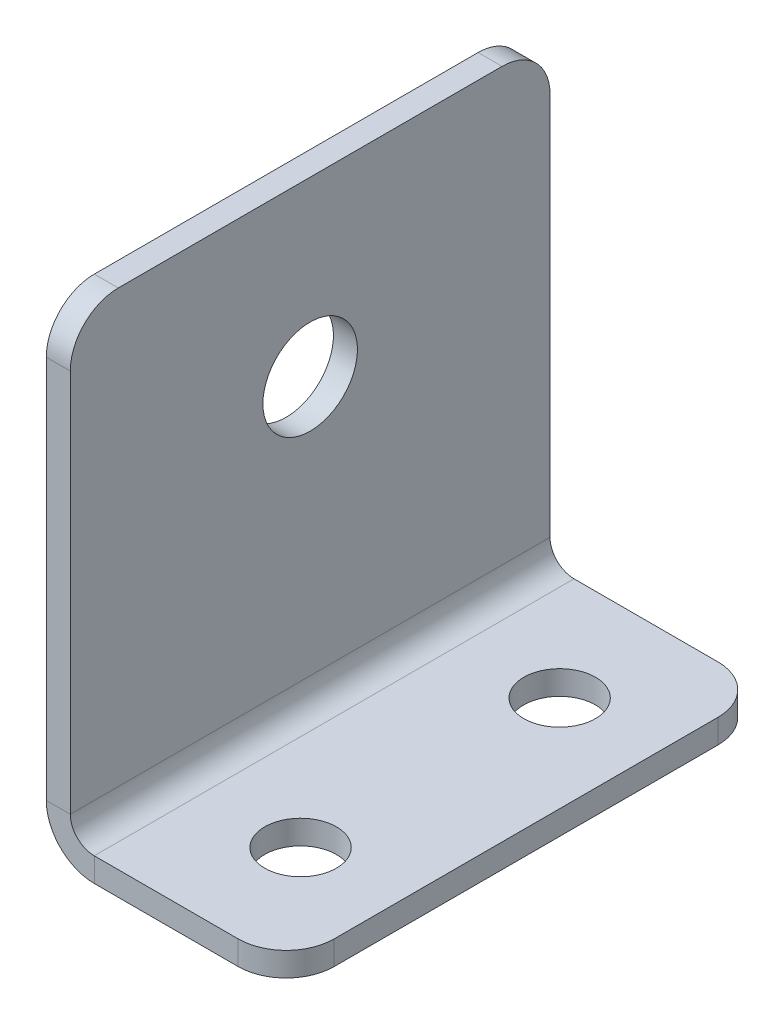
ISO-10303-21;
HEADER;
FILE_DESCRIPTION(('STEP AP214'),'2;1');
FILE_NAME('part.step','',(''),(''),'','','');
FILE_SCHEMA(('AUTOMOTIVE_DESIGN { 1 0 10303 214 1 1 1 1 }'));
ENDSEC;
DATA;
#1=APPLICATION_CONTEXT('core data for automotive mechanical design processes');
#2=APPLICATION_PROTOCOL_DEFINITION('international standard','automotive_design',2000,#1);
#3=PRODUCT_CONTEXT('',#1,'mechanical');
#4=PRODUCT('Part','Part','',(#3));
#5=PRODUCT_RELATED_PRODUCT_CATEGORY('part','',(#4));
#6=PRODUCT_DEFINITION_FORMATION('','',#4);
#7=PRODUCT_DEFINITION_CONTEXT('part definition',#1,'design');
#8=PRODUCT_DEFINITION('design','',#6,#7);
#9=PRODUCT_DEFINITION_SHAPE('','',#8);
#10=(LENGTH_UNIT() NAMED_UNIT(*) SI_UNIT(.MILLI.,.METRE.));
#11=(NAMED_UNIT(*) PLANE_ANGLE_UNIT() SI_UNIT($,.RADIAN.));
#12=(NAMED_UNIT(*) SI_UNIT($,.STERADIAN.) SOLID_ANGLE_UNIT());
#13=UNCERTAINTY_MEASURE_WITH_UNIT(LENGTH_MEASURE(1.E-05),#10,'distance_accuracy_value','');
#14=(GEOMETRIC_REPRESENTATION_CONTEXT(3) GLOBAL_UNCERTAINTY_ASSIGNED_CONTEXT((#13)) GLOBAL_UNIT_ASSIGNED_CONTEXT((#10,
#11,#12)) REPRESENTATION_CONTEXT('',''));
#15=CARTESIAN_POINT('',(0.,0.,0.));
#16=DIRECTION('',(0.,0.,1.));
#17=DIRECTION('',(1.,0.,0.));
#18=AXIS2_PLACEMENT_3D('',#15,#16,#17);
#19=CARTESIAN_POINT('',(1.27,1.27,0.));
#20=DIRECTION('',(0.,0.,1.));
#21=DIRECTION('',(0.,1.,0.));
#22=AXIS2_PLACEMENT_3D('',#19,#20,#21);
#23=PLANE('',#22);
#24=DIRECTION('',(0.,1.,0.));
#25=VECTOR('',#24,1.);
#26=CARTESIAN_POINT('',(0.,1.27,0.));
#27=LINE('',#26,#25);
#28=CARTESIAN_POINT('',(0.,2.54,0.));
#29=VERTEX_POINT('',#28);
#30=CARTESIAN_POINT('',(0.,22.86,0.));
#31=VERTEX_POINT('',#30);
#32=EDGE_CURVE('E204',#29,#31,#27,.T.);
#33=ORIENTED_EDGE('',*,*,#32,.T.);
#34=DIRECTION('',(1.,0.,0.));
#35=VECTOR('',#34,1.);
#36=CARTESIAN_POINT('',(1.27,22.86,0.));
#37=LINE('',#36,#35);
#38=CARTESIAN_POINT('',(1.27,22.86,0.));
#39=VERTEX_POINT('',#38);
#40=EDGE_CURVE('E171',#31,#39,#37,.T.);
#41=ORIENTED_EDGE('',*,*,#40,.T.);
#42=DIRECTION('',(0.,1.,0.));
#43=VECTOR('',#42,1.);
#44=CARTESIAN_POINT('',(1.27,1.27,0.));
#45=LINE('',#44,#43);
#46=CARTESIAN_POINT('',(1.27,2.54,0.));
#47=VERTEX_POINT('',#46);
#48=EDGE_CURVE('E169',#47,#39,#45,.T.);
#49=ORIENTED_EDGE('',*,*,#48,.F.);
#50=DIRECTION('',(1.,0.,0.));
#51=VECTOR('',#50,1.);
#52=CARTESIAN_POINT('',(1.27,2.54,0.));
#53=LINE('',#52,#51);
#54=EDGE_CURVE('E141',#29,#47,#53,.T.);
#55=ORIENTED_EDGE('',*,*,#54,.F.);
#56=EDGE_LOOP('',(#33,#41,#49,#55));
#57=FACE_BOUND('',#56,.T.);
#58=ADVANCED_FACE('F50',(#57),#23,.F.);
#59=CARTESIAN_POINT('',(1.27,25.4,25.4));
#60=DIRECTION('',(0.,1.,0.));
#61=DIRECTION('',(0.,0.,-1.));
#62=AXIS2_PLACEMENT_3D('',#59,#60,#61);
#63=PLANE('',#62);
#64=DIRECTION('',(0.,0.,-1.));
#65=VECTOR('',#64,1.);
#66=CARTESIAN_POINT('',(1.27,25.4,25.4));
#67=LINE('',#66,#65);
#68=CARTESIAN_POINT('',(1.27,25.4,22.86));
#69=VERTEX_POINT('',#68);
#70=CARTESIAN_POINT('',(1.27,25.4,2.54));
#71=VERTEX_POINT('',#70);
#72=EDGE_CURVE('E173',#69,#71,#67,.T.);
#73=ORIENTED_EDGE('',*,*,#72,.T.);
#74=DIRECTION('',(-1.,0.,0.));
#75=VECTOR('',#74,1.);
#76=CARTESIAN_POINT('',(1.27,25.4,2.54));
#77=LINE('',#76,#75);
#78=CARTESIAN_POINT('',(0.,25.4,2.54));
#79=VERTEX_POINT('',#78);
#80=EDGE_CURVE('E71',#71,#79,#77,.T.);
#81=ORIENTED_EDGE('',*,*,#80,.T.);
#82=DIRECTION('',(0.,0.,1.));
#83=VECTOR('',#82,1.);
#84=CARTESIAN_POINT('',(0.,25.4,25.4));
#85=LINE('',#84,#83);
#86=CARTESIAN_POINT('',(0.,25.4,22.86));
#87=VERTEX_POINT('',#86);
#88=EDGE_CURVE('E206',#87,#79,#85,.F.);
#89=ORIENTED_EDGE('',*,*,#88,.F.);
#90=DIRECTION('',(1.,0.,0.));
#91=VECTOR('',#90,1.);
#92=CARTESIAN_POINT('',(1.27,25.4,22.86));
#93=LINE('',#92,#91);
#94=EDGE_CURVE('E239',#87,#69,#93,.T.);
#95=ORIENTED_EDGE('',*,*,#94,.T.);
#96=EDGE_LOOP('',(#73,#81,#89,#95));
#97=FACE_BOUND('',#96,.T.);
#98=ADVANCED_FACE('F252',(#97),#63,.T.);
#99=CARTESIAN_POINT('',(1.27,1.27,25.4));
#100=DIRECTION('',(0.,0.,1.));
#101=DIRECTION('',(0.,1.,0.));
#102=AXIS2_PLACEMENT_3D('',#99,#100,#101);
#103=PLANE('',#102);
#104=DIRECTION('',(0.,1.,0.));
#105=VECTOR('',#104,1.);
#106=CARTESIAN_POINT('',(1.27,1.27,25.4));
#107=LINE('',#106,#105);
#108=CARTESIAN_POINT('',(1.27,2.54,25.4));
#109=VERTEX_POINT('',#108);
#110=CARTESIAN_POINT('',(1.27,22.86,25.4));
#111=VERTEX_POINT('',#110);
#112=EDGE_CURVE('E177',#109,#111,#107,.T.);
#113=ORIENTED_EDGE('',*,*,#112,.T.);
#114=DIRECTION('',(1.,0.,0.));
#115=VECTOR('',#114,1.);
#116=CARTESIAN_POINT('',(1.27,22.86,25.4));
#117=LINE('',#116,#115);
#118=CARTESIAN_POINT('',(0.,22.86,25.4));
#119=VERTEX_POINT('',#118);
#120=EDGE_CURVE('E13',#111,#119,#117,.F.);
#121=ORIENTED_EDGE('',*,*,#120,.T.);
#122=DIRECTION('',(0.,1.,0.));
#123=VECTOR('',#122,1.);
#124=CARTESIAN_POINT('',(0.,1.27,25.4));
#125=LINE('',#124,#123);
#126=CARTESIAN_POINT('',(0.,2.54,25.4));
#127=VERTEX_POINT('',#126);
#128=EDGE_CURVE('E197',#127,#119,#125,.T.);
#129=ORIENTED_EDGE('',*,*,#128,.F.);
#130=DIRECTION('',(1.,0.,0.));
#131=VECTOR('',#130,1.);
#132=CARTESIAN_POINT('',(1.27,2.54,25.4));
#133=LINE('',#132,#131);
#134=EDGE_CURVE('E154',#127,#109,#133,.T.);
#135=ORIENTED_EDGE('',*,*,#134,.T.);
#136=EDGE_LOOP('',(#113,#121,#129,#135));
#137=FACE_BOUND('',#136,.T.);
#138=ADVANCED_FACE('F284',(#137),#103,.T.);
#139=CARTESIAN_POINT('',(2.54,2.54,25.4));
#140=DIRECTION('',(0.,0.,1.));
#141=DIRECTION('',(1.,0.,0.));
#142=AXIS2_PLACEMENT_3D('',#139,#140,#141);
#143=PLANE('',#142);
#144=ORIENTED_EDGE('',*,*,#134,.F.);
#145=CARTESIAN_POINT('',(2.54,2.54,25.4));
#146=DIRECTION('',(0.,0.,1.));
#147=DIRECTION('',(1.,0.,0.));
#148=AXIS2_PLACEMENT_3D('',#145,#146,#147);
#149=CIRCLE('',#148,2.54);
#150=CARTESIAN_POINT('',(2.54,0.,25.4));
#151=VERTEX_POINT('',#150);
#152=EDGE_CURVE('E201',#127,#151,#149,.T.);
#153=ORIENTED_EDGE('',*,*,#152,.T.);
#154=DIRECTION('',(0.,1.,0.));
#155=VECTOR('',#154,1.);
#156=CARTESIAN_POINT('',(2.54,1.27,25.4));
#157=LINE('',#156,#155);
#158=CARTESIAN_POINT('',(2.54,1.27,25.4));
#159=VERTEX_POINT('',#158);
#160=EDGE_CURVE('E211',#151,#159,#157,.T.);
#161=ORIENTED_EDGE('',*,*,#160,.T.);
#162=CARTESIAN_POINT('',(2.54,2.54,25.4));
#163=DIRECTION('',(0.,0.,-1.));
#164=DIRECTION('',(-1.,0.,0.));
#165=AXIS2_PLACEMENT_3D('',#162,#163,#164);
#166=CIRCLE('',#165,1.27);
#167=EDGE_CURVE('E164',#109,#159,#166,.F.);
#168=ORIENTED_EDGE('',*,*,#167,.F.);
#169=EDGE_LOOP('',(#144,#153,#161,#168));
#170=FACE_BOUND('',#169,.T.);
#171=ADVANCED_FACE('F267',(#170),#143,.T.);
#172=CARTESIAN_POINT('',(1.27,1.27,25.4));
#173=DIRECTION('',(0.,0.,1.));
#174=DIRECTION('',(-1.,0.,0.));
#175=AXIS2_PLACEMENT_3D('',#172,#173,#174);
#176=PLANE('',#175);
#177=DIRECTION('',(1.,0.,0.));
#178=VECTOR('',#177,1.);
#179=CARTESIAN_POINT('',(1.27,0.,25.4));
#180=LINE('',#179,#178);
#181=CARTESIAN_POINT('',(10.16,0.,25.4));
#182=VERTEX_POINT('',#181);
#183=EDGE_CURVE('E196',#182,#151,#180,.F.);
#184=ORIENTED_EDGE('',*,*,#183,.F.);
#185=DIRECTION('',(0.,-1.,0.));
#186=VECTOR('',#185,1.);
#187=CARTESIAN_POINT('',(10.16,1.27,25.4));
#188=LINE('',#187,#186);
#189=CARTESIAN_POINT('',(10.16,1.27,25.4));
#190=VERTEX_POINT('',#189);
#191=EDGE_CURVE('E153',#182,#190,#188,.F.);
#192=ORIENTED_EDGE('',*,*,#191,.T.);
#193=DIRECTION('',(-1.,0.,0.));
#194=VECTOR('',#193,1.);
#195=CARTESIAN_POINT('',(1.27,1.27,25.4));
#196=LINE('',#195,#194);
#197=EDGE_CURVE('E184',#190,#159,#196,.T.);
#198=ORIENTED_EDGE('',*,*,#197,.T.);
#199=ORIENTED_EDGE('',*,*,#160,.F.);
#200=EDGE_LOOP('',(#184,#192,#198,#199));
#201=FACE_BOUND('',#200,.T.);
#202=ADVANCED_FACE('F263',(#201),#176,.T.);
#203=CARTESIAN_POINT('',(12.7,1.27,25.4));
#204=DIRECTION('',(-1.,0.,0.));
#205=DIRECTION('',(0.,0.,-1.));
#206=AXIS2_PLACEMENT_3D('',#203,#204,#205);
#207=PLANE('',#206);
#208=DIRECTION('',(0.,0.,-1.));
#209=VECTOR('',#208,1.);
#210=CARTESIAN_POINT('',(12.7,1.27,25.4));
#211=LINE('',#210,#209);
#212=CARTESIAN_POINT('',(12.7,1.27,22.86));
#213=VERTEX_POINT('',#212);
#214=CARTESIAN_POINT('',(12.7,1.27,2.54));
#215=VERTEX_POINT('',#214);
#216=EDGE_CURVE('E179',#213,#215,#211,.T.);
#217=ORIENTED_EDGE('',*,*,#216,.F.);
#218=DIRECTION('',(0.,1.,0.));
#219=VECTOR('',#218,1.);
#220=CARTESIAN_POINT('',(12.7,1.27,22.86));
#221=LINE('',#220,#219);
#222=CARTESIAN_POINT('',(12.7,0.,22.86));
#223=VERTEX_POINT('',#222);
#224=EDGE_CURVE('E226',#213,#223,#221,.F.);
#225=ORIENTED_EDGE('',*,*,#224,.T.);
#226=DIRECTION('',(0.,0.,-1.));
#227=VECTOR('',#226,1.);
#228=CARTESIAN_POINT('',(12.7,0.,25.4));
#229=LINE('',#228,#227);
#230=CARTESIAN_POINT('',(12.7,0.,2.54));
#231=VERTEX_POINT('',#230);
#232=EDGE_CURVE('E193',#223,#231,#229,.T.);
#233=ORIENTED_EDGE('',*,*,#232,.T.);
#234=DIRECTION('',(0.,-1.,0.));
#235=VECTOR('',#234,1.);
#236=CARTESIAN_POINT('',(12.7,1.27,2.54));
#237=LINE('',#236,#235);
#238=EDGE_CURVE('E223',#231,#215,#237,.F.);
#239=ORIENTED_EDGE('',*,*,#238,.T.);
#240=EDGE_LOOP('',(#217,#225,#233,#239));
#241=FACE_BOUND('',#240,.T.);
#242=ADVANCED_FACE('F348',(#241),#207,.F.);
#243=CARTESIAN_POINT('',(1.27,1.27,0.));
#244=DIRECTION('',(0.,0.,1.));
#245=DIRECTION('',(-1.,0.,0.));
#246=AXIS2_PLACEMENT_3D('',#243,#244,#245);
#247=PLANE('',#246);
#248=DIRECTION('',(-1.,0.,0.));
#249=VECTOR('',#248,1.);
#250=CARTESIAN_POINT('',(1.27,1.27,0.));
#251=LINE('',#250,#249);
#252=CARTESIAN_POINT('',(10.16,1.27,0.));
#253=VERTEX_POINT('',#252);
#254=CARTESIAN_POINT('',(2.54,1.27,0.));
#255=VERTEX_POINT('',#254);
#256=EDGE_CURVE('E255',#253,#255,#251,.T.);
#257=ORIENTED_EDGE('',*,*,#256,.F.);
#258=DIRECTION('',(0.,-1.,0.));
#259=VECTOR('',#258,1.);
#260=CARTESIAN_POINT('',(10.16,1.27,0.));
#261=LINE('',#260,#259);
#262=CARTESIAN_POINT('',(10.16,0.,0.));
#263=VERTEX_POINT('',#262);
#264=EDGE_CURVE('E232',#253,#263,#261,.T.);
#265=ORIENTED_EDGE('',*,*,#264,.T.);
#266=DIRECTION('',(1.,0.,0.));
#267=VECTOR('',#266,1.);
#268=CARTESIAN_POINT('',(1.27,0.,0.));
#269=LINE('',#268,#267);
#270=CARTESIAN_POINT('',(2.54,0.,0.));
#271=VERTEX_POINT('',#270);
#272=EDGE_CURVE('E194',#263,#271,#269,.F.);
#273=ORIENTED_EDGE('',*,*,#272,.T.);
#274=DIRECTION('',(0.,1.,0.));
#275=VECTOR('',#274,1.);
#276=CARTESIAN_POINT('',(2.54,1.27,0.));
#277=LINE('',#276,#275);
#278=EDGE_CURVE('E181',#271,#255,#277,.T.);
#279=ORIENTED_EDGE('',*,*,#278,.T.);
#280=EDGE_LOOP('',(#257,#265,#273,#279));
#281=FACE_BOUND('',#280,.T.);
#282=ADVANCED_FACE('F273',(#281),#247,.F.);
#283=CARTESIAN_POINT('',(2.54,2.54,0.));
#284=DIRECTION('',(0.,0.,-1.));
#285=DIRECTION('',(-1.,0.,0.));
#286=AXIS2_PLACEMENT_3D('',#283,#284,#285);
#287=PLANE('',#286);
#288=CARTESIAN_POINT('',(2.54,2.54,0.));
#289=DIRECTION('',(0.,0.,1.));
#290=DIRECTION('',(1.,0.,0.));
#291=AXIS2_PLACEMENT_3D('',#288,#289,#290);
#292=CIRCLE('',#291,2.54);
#293=EDGE_CURVE('E148',#271,#29,#292,.F.);
#294=ORIENTED_EDGE('',*,*,#293,.T.);
#295=ORIENTED_EDGE('',*,*,#54,.T.);
#296=CARTESIAN_POINT('',(2.54,2.54,0.));
#297=DIRECTION('',(0.,0.,1.));
#298=DIRECTION('',(1.,0.,0.));
#299=AXIS2_PLACEMENT_3D('',#296,#297,#298);
#300=CIRCLE('',#299,1.27);
#301=EDGE_CURVE('E145',#255,#47,#300,.F.);
#302=ORIENTED_EDGE('',*,*,#301,.F.);
#303=ORIENTED_EDGE('',*,*,#278,.F.);
#304=EDGE_LOOP('',(#294,#295,#302,#303));
#305=FACE_BOUND('',#304,.T.);
#306=ADVANCED_FACE('F143',(#305),#287,.T.);
#307=CARTESIAN_POINT('',(1.27,1.27,25.4));
#308=DIRECTION('',(0.,-1.,0.));
#309=DIRECTION('',(0.,0.,-1.));
#310=AXIS2_PLACEMENT_3D('',#307,#308,#309);
#311=PLANE('',#310);
#312=CARTESIAN_POINT('',(7.62,1.27,19.558));
#313=DIRECTION('',(0.,1.,0.));
#314=DIRECTION('',(0.,0.,1.));
#315=AXIS2_PLACEMENT_3D('',#312,#313,#314);
#316=CIRCLE('',#315,1.89865);
#317=CARTESIAN_POINT('',(7.62,1.27,21.45665));
#318=VERTEX_POINT('',#317);
#319=EDGE_CURVE('E538',#318,#318,#316,.T.);
#320=ORIENTED_EDGE('',*,*,#319,.F.);
#321=EDGE_LOOP('',(#320));
#322=FACE_BOUND('',#321,.T.);
#323=CARTESIAN_POINT('',(7.62,1.27,5.842));
#324=DIRECTION('',(0.,1.,0.));
#325=DIRECTION('',(0.,0.,1.));
#326=AXIS2_PLACEMENT_3D('',#323,#324,#325);
#327=CIRCLE('',#326,1.89865);
#328=CARTESIAN_POINT('',(7.62,1.27,7.74065));
#329=VERTEX_POINT('',#328);
#330=EDGE_CURVE('E532',#329,#329,#327,.T.);
#331=ORIENTED_EDGE('',*,*,#330,.F.);
#332=EDGE_LOOP('',(#331));
#333=FACE_BOUND('',#332,.T.);
#334=ORIENTED_EDGE('',*,*,#197,.F.);
#335=CARTESIAN_POINT('',(10.16,1.27,22.86));
#336=DIRECTION('',(0.,-1.,0.));
#337=DIRECTION('',(0.,0.,-1.));
#338=AXIS2_PLACEMENT_3D('',#335,#336,#337);
#339=CIRCLE('',#338,2.54);
#340=EDGE_CURVE('E221',#190,#213,#339,.F.);
#341=ORIENTED_EDGE('',*,*,#340,.T.);
#342=ORIENTED_EDGE('',*,*,#216,.T.);
#343=CARTESIAN_POINT('',(10.16,1.27,2.54));
#344=DIRECTION('',(0.,-1.,0.));
#345=DIRECTION('',(0.,0.,-1.));
#346=AXIS2_PLACEMENT_3D('',#343,#344,#345);
#347=CIRCLE('',#346,2.54);
#348=EDGE_CURVE('E219',#215,#253,#347,.F.);
#349=ORIENTED_EDGE('',*,*,#348,.T.);
#350=ORIENTED_EDGE('',*,*,#256,.T.);
#351=DIRECTION('',(0.,0.,-1.));
#352=VECTOR('',#351,1.);
#353=CARTESIAN_POINT('',(2.54,1.27,25.4));
#354=LINE('',#353,#352);
#355=EDGE_CURVE('E163',#255,#159,#354,.F.);
#356=ORIENTED_EDGE('',*,*,#355,.T.);
#357=EDGE_LOOP('',(#334,#341,#342,#349,#350,#356));
#358=FACE_BOUND('',#357,.T.);
#359=ADVANCED_FACE('F269',(#322,#333,#358),#311,.F.);
#360=CARTESIAN_POINT('',(1.27,1.27,25.4));
#361=DIRECTION('',(-1.,0.,0.));
#362=DIRECTION('',(0.,0.,1.));
#363=AXIS2_PLACEMENT_3D('',#360,#361,#362);
#364=PLANE('',#363);
#365=CARTESIAN_POINT('',(1.27,16.256,12.7));
#366=DIRECTION('',(-1.,0.,0.));
#367=DIRECTION('',(0.,0.,1.));
#368=AXIS2_PLACEMENT_3D('',#365,#366,#367);
#369=CIRCLE('',#368,2.5019);
#370=CARTESIAN_POINT('',(1.27,16.256,15.2019));
#371=VERTEX_POINT('',#370);
#372=EDGE_CURVE('E210',#371,#371,#369,.T.);
#373=ORIENTED_EDGE('',*,*,#372,.T.);
#374=EDGE_LOOP('',(#373));
#375=FACE_BOUND('',#374,.T.);
#376=ORIENTED_EDGE('',*,*,#48,.T.);
#377=CARTESIAN_POINT('',(1.27,22.86,2.54));
#378=DIRECTION('',(-1.,0.,0.));
#379=DIRECTION('',(0.,0.,1.));
#380=AXIS2_PLACEMENT_3D('',#377,#378,#379);
#381=CIRCLE('',#380,2.54);
#382=EDGE_CURVE('E237',#39,#71,#381,.F.);
#383=ORIENTED_EDGE('',*,*,#382,.T.);
#384=ORIENTED_EDGE('',*,*,#72,.F.);
#385=CARTESIAN_POINT('',(1.27,22.86,22.86));
#386=DIRECTION('',(-1.,0.,0.));
#387=DIRECTION('',(0.,0.,1.));
#388=AXIS2_PLACEMENT_3D('',#385,#386,#387);
#389=CIRCLE('',#388,2.54);
#390=EDGE_CURVE('E235',#69,#111,#389,.F.);
#391=ORIENTED_EDGE('',*,*,#390,.T.);
#392=ORIENTED_EDGE('',*,*,#112,.F.);
#393=DIRECTION('',(0.,0.,-1.));
#394=VECTOR('',#393,1.);
#395=CARTESIAN_POINT('',(1.27,2.54,0.));
#396=LINE('',#395,#394);
#397=EDGE_CURVE('E161',#109,#47,#396,.T.);
#398=ORIENTED_EDGE('',*,*,#397,.T.);
#399=EDGE_LOOP('',(#376,#383,#384,#391,#392,#398));
#400=FACE_BOUND('',#399,.T.);
#401=ADVANCED_FACE('F176',(#375,#400),#364,.F.);
#402=CARTESIAN_POINT('',(2.54,2.54,25.4));
#403=DIRECTION('',(0.,0.,1.));
#404=DIRECTION('',(1.,0.,0.));
#405=AXIS2_PLACEMENT_3D('',#402,#403,#404);
#406=CYLINDRICAL_SURFACE('',#405,1.27);
#407=ORIENTED_EDGE('',*,*,#167,.T.);
#408=ORIENTED_EDGE('',*,*,#355,.F.);
#409=ORIENTED_EDGE('',*,*,#301,.T.);
#410=ORIENTED_EDGE('',*,*,#397,.F.);
#411=EDGE_LOOP('',(#407,#408,#409,#410));
#412=FACE_BOUND('',#411,.T.);
#413=ADVANCED_FACE('F159',(#412),#406,.F.);
#414=CARTESIAN_POINT('',(1.27,0.,25.4));
#415=DIRECTION('',(0.,-1.,0.));
#416=DIRECTION('',(0.,0.,-1.));
#417=AXIS2_PLACEMENT_3D('',#414,#415,#416);
#418=PLANE('',#417);
#419=CARTESIAN_POINT('',(7.62,0.,19.558));
#420=DIRECTION('',(0.,1.,0.));
#421=DIRECTION('',(0.,0.,1.));
#422=AXIS2_PLACEMENT_3D('',#419,#420,#421);
#423=CIRCLE('',#422,1.89865);
#424=CARTESIAN_POINT('',(7.62,0.,21.45665));
#425=VERTEX_POINT('',#424);
#426=EDGE_CURVE('E536',#425,#425,#423,.T.);
#427=ORIENTED_EDGE('',*,*,#426,.T.);
#428=EDGE_LOOP('',(#427));
#429=FACE_BOUND('',#428,.T.);
#430=CARTESIAN_POINT('',(7.62,0.,5.842));
#431=DIRECTION('',(0.,1.,0.));
#432=DIRECTION('',(0.,0.,1.));
#433=AXIS2_PLACEMENT_3D('',#430,#431,#432);
#434=CIRCLE('',#433,1.89865);
#435=CARTESIAN_POINT('',(7.62,0.,7.74065));
#436=VERTEX_POINT('',#435);
#437=EDGE_CURVE('E528',#436,#436,#434,.T.);
#438=ORIENTED_EDGE('',*,*,#437,.T.);
#439=EDGE_LOOP('',(#438));
#440=FACE_BOUND('',#439,.T.);
#441=ORIENTED_EDGE('',*,*,#232,.F.);
#442=CARTESIAN_POINT('',(10.16,0.,22.86));
#443=DIRECTION('',(0.,-1.,0.));
#444=DIRECTION('',(0.,0.,-1.));
#445=AXIS2_PLACEMENT_3D('',#442,#443,#444);
#446=CIRCLE('',#445,2.54);
#447=EDGE_CURVE('E230',#223,#182,#446,.T.);
#448=ORIENTED_EDGE('',*,*,#447,.T.);
#449=ORIENTED_EDGE('',*,*,#183,.T.);
#450=DIRECTION('',(0.,0.,-1.));
#451=VECTOR('',#450,1.);
#452=CARTESIAN_POINT('',(2.54,0.,25.4));
#453=LINE('',#452,#451);
#454=EDGE_CURVE('E165',#271,#151,#453,.F.);
#455=ORIENTED_EDGE('',*,*,#454,.F.);
#456=ORIENTED_EDGE('',*,*,#272,.F.);
#457=CARTESIAN_POINT('',(10.16,0.,2.54));
#458=DIRECTION('',(0.,-1.,0.));
#459=DIRECTION('',(0.,0.,-1.));
#460=AXIS2_PLACEMENT_3D('',#457,#458,#459);
#461=CIRCLE('',#460,2.54);
#462=EDGE_CURVE('E228',#263,#231,#461,.T.);
#463=ORIENTED_EDGE('',*,*,#462,.T.);
#464=EDGE_LOOP('',(#441,#448,#449,#455,#456,#463));
#465=FACE_BOUND('',#464,.T.);
#466=ADVANCED_FACE('F278',(#429,#440,#465),#418,.T.);
#467=CARTESIAN_POINT('',(0.,1.27,25.4));
#468=DIRECTION('',(-1.,0.,0.));
#469=DIRECTION('',(0.,0.,1.));
#470=AXIS2_PLACEMENT_3D('',#467,#468,#469);
#471=PLANE('',#470);
#472=CARTESIAN_POINT('',(0.,16.256,12.7));
#473=DIRECTION('',(-1.,0.,0.));
#474=DIRECTION('',(0.,0.,1.));
#475=AXIS2_PLACEMENT_3D('',#472,#473,#474);
#476=CIRCLE('',#475,2.5019);
#477=CARTESIAN_POINT('',(0.,16.256,15.2019));
#478=VERTEX_POINT('',#477);
#479=EDGE_CURVE('E527',#478,#478,#476,.T.);
#480=ORIENTED_EDGE('',*,*,#479,.F.);
#481=EDGE_LOOP('',(#480));
#482=FACE_BOUND('',#481,.T.);
#483=ORIENTED_EDGE('',*,*,#88,.T.);
#484=CARTESIAN_POINT('',(0.,22.86,2.54));
#485=DIRECTION('',(-1.,0.,0.));
#486=DIRECTION('',(0.,0.,1.));
#487=AXIS2_PLACEMENT_3D('',#484,#485,#486);
#488=CIRCLE('',#487,2.54);
#489=EDGE_CURVE('E58',#79,#31,#488,.T.);
#490=ORIENTED_EDGE('',*,*,#489,.T.);
#491=ORIENTED_EDGE('',*,*,#32,.F.);
#492=DIRECTION('',(0.,0.,1.));
#493=VECTOR('',#492,1.);
#494=CARTESIAN_POINT('',(0.,2.54,25.4));
#495=LINE('',#494,#493);
#496=EDGE_CURVE('E191',#127,#29,#495,.F.);
#497=ORIENTED_EDGE('',*,*,#496,.F.);
#498=ORIENTED_EDGE('',*,*,#128,.T.);
#499=CARTESIAN_POINT('',(0.,22.86,22.86));
#500=DIRECTION('',(-1.,0.,0.));
#501=DIRECTION('',(0.,0.,1.));
#502=AXIS2_PLACEMENT_3D('',#499,#500,#501);
#503=CIRCLE('',#502,2.54);
#504=EDGE_CURVE('E243',#119,#87,#503,.T.);
#505=ORIENTED_EDGE('',*,*,#504,.T.);
#506=EDGE_LOOP('',(#483,#490,#491,#497,#498,#505));
#507=FACE_BOUND('',#506,.T.);
#508=ADVANCED_FACE('F247',(#482,#507),#471,.T.);
#509=CARTESIAN_POINT('',(2.54,2.54,25.4));
#510=DIRECTION('',(0.,0.,1.));
#511=DIRECTION('',(1.,0.,0.));
#512=AXIS2_PLACEMENT_3D('',#509,#510,#511);
#513=CYLINDRICAL_SURFACE('',#512,2.54);
#514=ORIENTED_EDGE('',*,*,#152,.F.);
#515=ORIENTED_EDGE('',*,*,#496,.T.);
#516=ORIENTED_EDGE('',*,*,#293,.F.);
#517=ORIENTED_EDGE('',*,*,#454,.T.);
#518=EDGE_LOOP('',(#514,#515,#516,#517));
#519=FACE_BOUND('',#518,.T.);
#520=ADVANCED_FACE('F281',(#519),#513,.T.);
#521=CARTESIAN_POINT('',(12.7,16.256,12.7));
#522=DIRECTION('',(-1.,0.,0.));
#523=DIRECTION('',(0.,0.,1.));
#524=AXIS2_PLACEMENT_3D('',#521,#522,#523);
#525=CYLINDRICAL_SURFACE('',#524,2.5019);
#526=ORIENTED_EDGE('',*,*,#479,.T.);
#527=EDGE_LOOP('',(#526));
#528=FACE_BOUND('',#527,.T.);
#529=ORIENTED_EDGE('',*,*,#372,.F.);
#530=EDGE_LOOP('',(#529));
#531=FACE_BOUND('',#530,.T.);
#532=ADVANCED_FACE('F304',(#528,#531),#525,.F.);
#533=CARTESIAN_POINT('',(10.16,1.27,22.86));
#534=DIRECTION('',(0.,-1.,0.));
#535=DIRECTION('',(0.,0.,-1.));
#536=AXIS2_PLACEMENT_3D('',#533,#534,#535);
#537=CYLINDRICAL_SURFACE('',#536,2.54);
#538=ORIENTED_EDGE('',*,*,#447,.F.);
#539=ORIENTED_EDGE('',*,*,#224,.F.);
#540=ORIENTED_EDGE('',*,*,#340,.F.);
#541=ORIENTED_EDGE('',*,*,#191,.F.);
#542=EDGE_LOOP('',(#538,#539,#540,#541));
#543=FACE_BOUND('',#542,.T.);
#544=ADVANCED_FACE('F300',(#543),#537,.T.);
#545=CARTESIAN_POINT('',(10.16,1.27,2.54));
#546=DIRECTION('',(0.,1.,0.));
#547=DIRECTION('',(0.,0.,1.));
#548=AXIS2_PLACEMENT_3D('',#545,#546,#547);
#549=CYLINDRICAL_SURFACE('',#548,2.54);
#550=ORIENTED_EDGE('',*,*,#462,.F.);
#551=ORIENTED_EDGE('',*,*,#264,.F.);
#552=ORIENTED_EDGE('',*,*,#348,.F.);
#553=ORIENTED_EDGE('',*,*,#238,.F.);
#554=EDGE_LOOP('',(#550,#551,#552,#553));
#555=FACE_BOUND('',#554,.T.);
#556=ADVANCED_FACE('F303',(#555),#549,.T.);
#557=CARTESIAN_POINT('',(1.27,22.86,2.54));
#558=DIRECTION('',(-1.,0.,0.));
#559=DIRECTION('',(0.,0.,1.));
#560=AXIS2_PLACEMENT_3D('',#557,#558,#559);
#561=CYLINDRICAL_SURFACE('',#560,2.54);
#562=ORIENTED_EDGE('',*,*,#489,.F.);
#563=ORIENTED_EDGE('',*,*,#80,.F.);
#564=ORIENTED_EDGE('',*,*,#382,.F.);
#565=ORIENTED_EDGE('',*,*,#40,.F.);
#566=EDGE_LOOP('',(#562,#563,#564,#565));
#567=FACE_BOUND('',#566,.T.);
#568=ADVANCED_FACE('F250',(#567),#561,.T.);
#569=CARTESIAN_POINT('',(1.27,22.86,22.86));
#570=DIRECTION('',(1.,0.,0.));
#571=DIRECTION('',(0.,0.,-1.));
#572=AXIS2_PLACEMENT_3D('',#569,#570,#571);
#573=CYLINDRICAL_SURFACE('',#572,2.54);
#574=ORIENTED_EDGE('',*,*,#504,.F.);
#575=ORIENTED_EDGE('',*,*,#120,.F.);
#576=ORIENTED_EDGE('',*,*,#390,.F.);
#577=ORIENTED_EDGE('',*,*,#94,.F.);
#578=EDGE_LOOP('',(#574,#575,#576,#577));
#579=FACE_BOUND('',#578,.T.);
#580=ADVANCED_FACE('F52',(#579),#573,.T.);
#581=CARTESIAN_POINT('',(7.62,0.,5.842));
#582=DIRECTION('',(0.,1.,0.));
#583=DIRECTION('',(0.,0.,1.));
#584=AXIS2_PLACEMENT_3D('',#581,#582,#583);
#585=CYLINDRICAL_SURFACE('',#584,1.89865);
#586=ORIENTED_EDGE('',*,*,#437,.F.);
#587=EDGE_LOOP('',(#586));
#588=FACE_BOUND('',#587,.T.);
#589=ORIENTED_EDGE('',*,*,#330,.T.);
#590=EDGE_LOOP('',(#589));
#591=FACE_BOUND('',#590,.T.);
#592=ADVANCED_FACE('F312',(#588,#591),#585,.F.);
#593=CARTESIAN_POINT('',(7.62,0.,19.558));
#594=DIRECTION('',(0.,1.,0.));
#595=DIRECTION('',(0.,0.,1.));
#596=AXIS2_PLACEMENT_3D('',#593,#594,#595);
#597=CYLINDRICAL_SURFACE('',#596,1.89865);
#598=ORIENTED_EDGE('',*,*,#426,.F.);
#599=EDGE_LOOP('',(#598));
#600=FACE_BOUND('',#599,.T.);
#601=ORIENTED_EDGE('',*,*,#319,.T.);
#602=EDGE_LOOP('',(#601));
#603=FACE_BOUND('',#602,.T.);
#604=ADVANCED_FACE('F316',(#600,#603),#597,.F.);
#605=CLOSED_SHELL('',(#58,#98,#138,#171,#202,#242,#282,#306,#359,#401,#413,#466,#508,#520,#532,
#544,#556,#568,#580,#592,#604));
#606=MANIFOLD_SOLID_BREP('B2',#605);
#607=ADVANCED_BREP_SHAPE_REPRESENTATION('',(#18,#606),#14);
#608=SHAPE_DEFINITION_REPRESENTATION(#9,#607);
ENDSEC;
END-ISO-10303-21;
